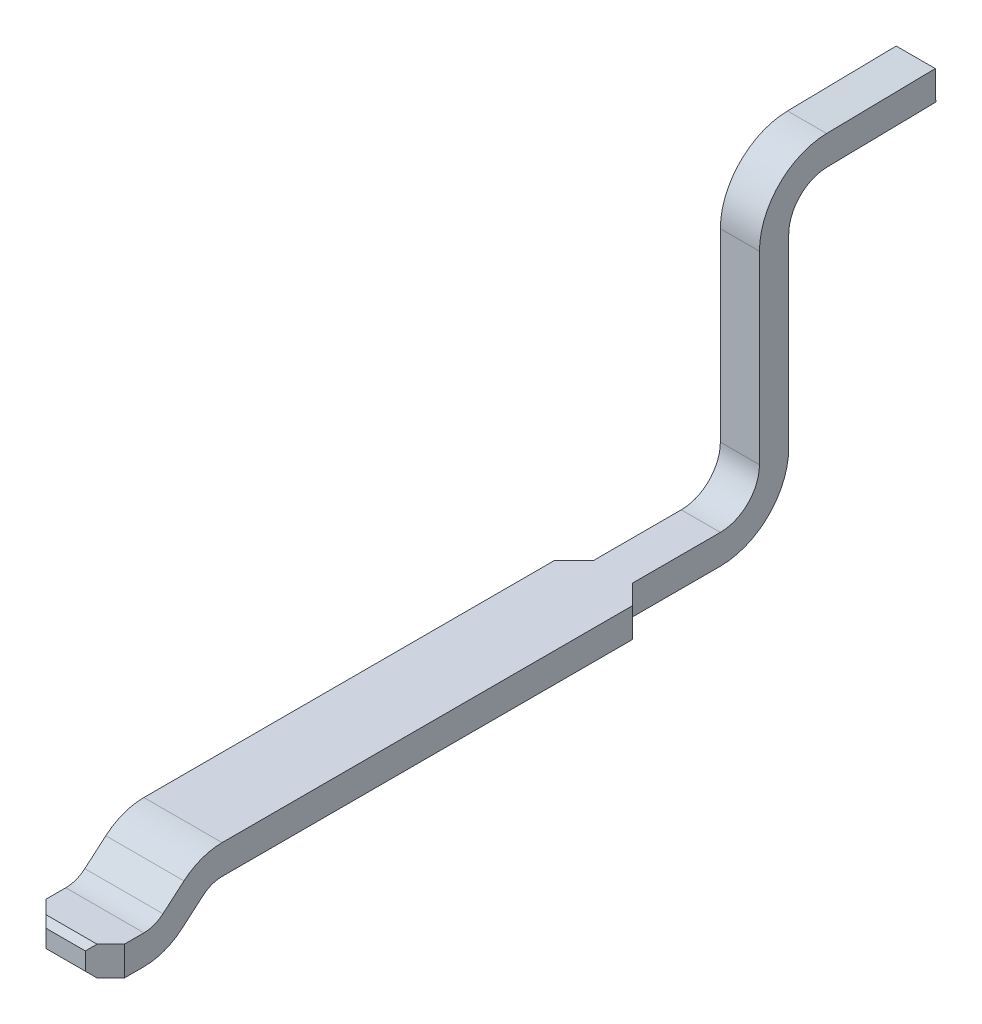
ISO-10303-21;
HEADER;
FILE_DESCRIPTION(('STEP AP214'),'2;1');
FILE_NAME('part.step','',(''),(''),'','','');
FILE_SCHEMA(('AUTOMOTIVE_DESIGN { 1 0 10303 214 1 1 1 1 }'));
ENDSEC;
DATA;
#1=APPLICATION_CONTEXT('core data for automotive mechanical design processes');
#2=APPLICATION_PROTOCOL_DEFINITION('international standard','automotive_design',2000,#1);
#3=PRODUCT_CONTEXT('',#1,'mechanical');
#4=PRODUCT('Part','Part','',(#3));
#5=PRODUCT_RELATED_PRODUCT_CATEGORY('part','',(#4));
#6=PRODUCT_DEFINITION_FORMATION('','',#4);
#7=PRODUCT_DEFINITION_CONTEXT('part definition',#1,'design');
#8=PRODUCT_DEFINITION('design','',#6,#7);
#9=PRODUCT_DEFINITION_SHAPE('','',#8);
#10=(LENGTH_UNIT() NAMED_UNIT(*) SI_UNIT(.MILLI.,.METRE.));
#11=(NAMED_UNIT(*) PLANE_ANGLE_UNIT() SI_UNIT($,.RADIAN.));
#12=(NAMED_UNIT(*) SI_UNIT($,.STERADIAN.) SOLID_ANGLE_UNIT());
#13=UNCERTAINTY_MEASURE_WITH_UNIT(LENGTH_MEASURE(1.E-05),#10,'distance_accuracy_value','');
#14=(GEOMETRIC_REPRESENTATION_CONTEXT(3) GLOBAL_UNCERTAINTY_ASSIGNED_CONTEXT((#13)) GLOBAL_UNIT_ASSIGNED_CONTEXT((#10,
#11,#12)) REPRESENTATION_CONTEXT('',''));
#15=CARTESIAN_POINT('',(0.,0.,0.));
#16=DIRECTION('',(0.,0.,1.));
#17=DIRECTION('',(1.,0.,0.));
#18=AXIS2_PLACEMENT_3D('',#15,#16,#17);
#19=CARTESIAN_POINT('',(-4.19596503503213,8.074228109921,4.324047830079));
#20=DIRECTION('',(0.,0.707106781186548,0.707106781186548));
#21=DIRECTION('',(0.,-0.707106781186548,0.707106781186548));
#22=AXIS2_PLACEMENT_3D('',#19,#20,#21);
#23=PLANE('',#22);
#24=DIRECTION('',(-0.577350269189631,0.577350269189615,-0.577350269189631));
#25=VECTOR('',#24,1.);
#26=CARTESIAN_POINT('',(-4.16026690000013,8.04019892,4.35807702));
#27=LINE('',#26,#25);
#28=CARTESIAN_POINT('',(-4.16026690000013,8.04019892,4.35807702));
#29=VERTEX_POINT('',#28);
#30=CARTESIAN_POINT('',(-4.19026690000013,8.07019892,4.32807702));
#31=VERTEX_POINT('',#30);
#32=EDGE_CURVE('E279',#29,#31,#27,.T.);
#33=ORIENTED_EDGE('',*,*,#32,.F.);
#34=DIRECTION('',(-1.,0.,0.));
#35=VECTOR('',#34,1.);
#36=CARTESIAN_POINT('',(-3.95456876496814,8.04019892,4.35807702));
#37=LINE('',#36,#35);
#38=CARTESIAN_POINT('',(-3.96026690000013,8.04019892,4.35807702));
#39=VERTEX_POINT('',#38);
#40=EDGE_CURVE('E356',#29,#39,#37,.F.);
#41=ORIENTED_EDGE('',*,*,#40,.T.);
#42=DIRECTION('',(-0.577350269189631,-0.577350269189615,0.577350269189631));
#43=VECTOR('',#42,1.);
#44=CARTESIAN_POINT('',(-3.93026690000013,8.07019892,4.32807702));
#45=LINE('',#44,#43);
#46=CARTESIAN_POINT('',(-3.93026690000013,8.07019892,4.32807702));
#47=VERTEX_POINT('',#46);
#48=EDGE_CURVE('E269',#47,#39,#45,.T.);
#49=ORIENTED_EDGE('',*,*,#48,.F.);
#50=DIRECTION('',(1.,0.,0.));
#51=VECTOR('',#50,1.);
#52=CARTESIAN_POINT('',(-3.85226690000013,8.07019892,4.32807702));
#53=LINE('',#52,#51);
#54=EDGE_CURVE('E276',#31,#47,#53,.T.);
#55=ORIENTED_EDGE('',*,*,#54,.F.);
#56=EDGE_LOOP('',(#33,#41,#49,#55));
#57=FACE_BOUND('',#56,.T.);
#58=ADVANCED_FACE('F17',(#57),#23,.T.);
#59=CARTESIAN_POINT('',(-3.95456876496814,7.944500784968,4.35807702));
#60=DIRECTION('',(0.,0.,-1.));
#61=DIRECTION('',(-1.,0.,0.));
#62=AXIS2_PLACEMENT_3D('',#59,#60,#61);
#63=PLANE('',#62);
#64=DIRECTION('',(0.,1.,0.));
#65=VECTOR('',#64,1.);
#66=CARTESIAN_POINT('',(-3.96026690000013,7.914500784968,4.35807702));
#67=LINE('',#66,#65);
#68=CARTESIAN_POINT('',(-3.96026690000013,7.95019892,4.35807702));
#69=VERTEX_POINT('',#68);
#70=EDGE_CURVE('E256',#39,#69,#67,.F.);
#71=ORIENTED_EDGE('',*,*,#70,.F.);
#72=ORIENTED_EDGE('',*,*,#40,.F.);
#73=DIRECTION('',(0.,1.,0.));
#74=VECTOR('',#73,1.);
#75=CARTESIAN_POINT('',(-4.16026690000013,7.914500784968,4.35807702));
#76=LINE('',#75,#74);
#77=CARTESIAN_POINT('',(-4.16026690000013,7.95019892,4.35807702));
#78=VERTEX_POINT('',#77);
#79=EDGE_CURVE('E338',#78,#29,#76,.T.);
#80=ORIENTED_EDGE('',*,*,#79,.F.);
#81=DIRECTION('',(1.,0.,0.));
#82=VECTOR('',#81,1.);
#83=CARTESIAN_POINT('',(-3.92456876496813,7.95019892,4.35807702));
#84=LINE('',#83,#82);
#85=EDGE_CURVE('E331',#69,#78,#84,.F.);
#86=ORIENTED_EDGE('',*,*,#85,.F.);
#87=EDGE_LOOP('',(#71,#72,#80,#86));
#88=FACE_BOUND('',#87,.T.);
#89=ADVANCED_FACE('F775',(#88),#63,.F.);
#90=CARTESIAN_POINT('',(-3.92456876496813,7.916169730079,4.324047830079));
#91=DIRECTION('',(0.,-0.707106781186548,0.707106781186548));
#92=DIRECTION('',(0.,-0.707106781186548,-0.707106781186548));
#93=AXIS2_PLACEMENT_3D('',#90,#91,#92);
#94=PLANE('',#93);
#95=DIRECTION('',(0.57735026918962,-0.577350269189637,-0.57735026918962));
#96=VECTOR('',#95,1.);
#97=CARTESIAN_POINT('',(-3.96026690000013,7.95019892,4.35807702));
#98=LINE('',#97,#96);
#99=CARTESIAN_POINT('',(-3.93026690000013,7.92019892,4.32807702));
#100=VERTEX_POINT('',#99);
#101=EDGE_CURVE('E270',#69,#100,#98,.T.);
#102=ORIENTED_EDGE('',*,*,#101,.F.);
#103=ORIENTED_EDGE('',*,*,#85,.T.);
#104=DIRECTION('',(0.57735026918962,0.577350269189637,0.57735026918962));
#105=VECTOR('',#104,1.);
#106=CARTESIAN_POINT('',(-4.19026690000013,7.92019892,4.32807702));
#107=LINE('',#106,#105);
#108=CARTESIAN_POINT('',(-4.19026690000013,7.92019892,4.32807702));
#109=VERTEX_POINT('',#108);
#110=EDGE_CURVE('E309',#109,#78,#107,.T.);
#111=ORIENTED_EDGE('',*,*,#110,.F.);
#112=DIRECTION('',(1.,0.,0.));
#113=VECTOR('',#112,1.);
#114=CARTESIAN_POINT('',(-3.85226690000013,7.92019892,4.32807702));
#115=LINE('',#114,#113);
#116=EDGE_CURVE('E252',#109,#100,#115,.T.);
#117=ORIENTED_EDGE('',*,*,#116,.T.);
#118=EDGE_LOOP('',(#102,#103,#111,#117));
#119=FACE_BOUND('',#118,.T.);
#120=ADVANCED_FACE('F768',(#119),#94,.T.);
#121=CARTESIAN_POINT('',(-3.95456876496814,8.45127780084181,0.758077020000001));
#122=DIRECTION('',(0.,0.,-1.));
#123=DIRECTION('',(-1.,0.,0.));
#124=AXIS2_PLACEMENT_3D('',#121,#122,#123);
#125=PLANE('',#124);
#126=DIRECTION('',(0.,1.,0.));
#127=VECTOR('',#126,1.);
#128=CARTESIAN_POINT('',(-3.96026690000013,9.610333059471,0.758077020000001));
#129=LINE('',#128,#127);
#130=CARTESIAN_POINT('',(-3.96026690000013,8.47019892,0.758077020000001));
#131=VERTEX_POINT('',#130);
#132=CARTESIAN_POINT('',(-3.96026690000013,9.41625487791,0.758077020000001));
#133=VERTEX_POINT('',#132);
#134=EDGE_CURVE('E416',#131,#133,#129,.T.);
#135=ORIENTED_EDGE('',*,*,#134,.F.);
#136=DIRECTION('',(-1.,0.,0.));
#137=VECTOR('',#136,1.);
#138=CARTESIAN_POINT('',(-3.96026690000013,8.47019892,0.75807702));
#139=LINE('',#138,#137);
#140=CARTESIAN_POINT('',(-4.16026690000013,8.47019892,0.758077020000001));
#141=VERTEX_POINT('',#140);
#142=EDGE_CURVE('E213',#141,#131,#139,.F.);
#143=ORIENTED_EDGE('',*,*,#142,.F.);
#144=DIRECTION('',(0.,1.,0.));
#145=VECTOR('',#144,1.);
#146=CARTESIAN_POINT('',(-4.16026690000013,8.45127780084181,0.758077020000001));
#147=LINE('',#146,#145);
#148=CARTESIAN_POINT('',(-4.16026690000013,9.41625487791,0.758077020000001));
#149=VERTEX_POINT('',#148);
#150=EDGE_CURVE('E412',#149,#141,#147,.F.);
#151=ORIENTED_EDGE('',*,*,#150,.F.);
#152=DIRECTION('',(1.,0.,0.));
#153=VECTOR('',#152,1.);
#154=CARTESIAN_POINT('',(-4.16026690000013,9.41625487791,0.758077020000001));
#155=LINE('',#154,#153);
#156=EDGE_CURVE('E306',#149,#133,#155,.T.);
#157=ORIENTED_EDGE('',*,*,#156,.T.);
#158=EDGE_LOOP('',(#135,#143,#151,#157));
#159=FACE_BOUND('',#158,.T.);
#160=ADVANCED_FACE('F579',(#159),#125,.T.);
#161=CARTESIAN_POINT('',(-3.96026690000013,8.47019892,1.10807702));
#162=DIRECTION('',(-1.,0.,0.));
#163=DIRECTION('',(0.,0.,1.));
#164=AXIS2_PLACEMENT_3D('',#161,#162,#163);
#165=CYLINDRICAL_SURFACE('',#164,0.35);
#166=DIRECTION('',(1.,0.,0.));
#167=VECTOR('',#166,1.);
#168=CARTESIAN_POINT('',(-3.85226690000013,8.12019892,1.10807702));
#169=LINE('',#168,#167);
#170=CARTESIAN_POINT('',(-3.96026690000013,8.12019892,1.10807702));
#171=VERTEX_POINT('',#170);
#172=CARTESIAN_POINT('',(-4.16026690000013,8.12019892,1.10807702));
#173=VERTEX_POINT('',#172);
#174=EDGE_CURVE('E229',#171,#173,#169,.F.);
#175=ORIENTED_EDGE('',*,*,#174,.T.);
#176=CARTESIAN_POINT('',(-4.16026690000013,8.47019892,1.10807702));
#177=DIRECTION('',(-1.,0.,0.));
#178=DIRECTION('',(0.,0.,1.));
#179=AXIS2_PLACEMENT_3D('',#176,#177,#178);
#180=CIRCLE('',#179,0.35);
#181=EDGE_CURVE('E409',#141,#173,#180,.T.);
#182=ORIENTED_EDGE('',*,*,#181,.F.);
#183=ORIENTED_EDGE('',*,*,#142,.T.);
#184=CARTESIAN_POINT('',(-3.96026690000013,8.47019892,1.10807702));
#185=DIRECTION('',(-1.,0.,0.));
#186=DIRECTION('',(0.,0.,1.));
#187=AXIS2_PLACEMENT_3D('',#184,#185,#186);
#188=CIRCLE('',#187,0.35);
#189=EDGE_CURVE('E417',#171,#131,#188,.F.);
#190=ORIENTED_EDGE('',*,*,#189,.F.);
#191=EDGE_LOOP('',(#175,#182,#183,#190));
#192=FACE_BOUND('',#191,.T.);
#193=ADVANCED_FACE('F576',(#192),#165,.T.);
#194=CARTESIAN_POINT('',(-3.95456876496814,8.45127780084181,0.908077020000001));
#195=DIRECTION('',(0.,0.,-1.));
#196=DIRECTION('',(-1.,0.,0.));
#197=AXIS2_PLACEMENT_3D('',#194,#195,#196);
#198=PLANE('',#197);
#199=DIRECTION('',(-1.,0.,0.));
#200=VECTOR('',#199,1.);
#201=CARTESIAN_POINT('',(-3.96026690000013,8.47019892,0.90807702));
#202=LINE('',#201,#200);
#203=CARTESIAN_POINT('',(-4.16026690000013,8.47019892,0.908077020000001));
#204=VERTEX_POINT('',#203);
#205=CARTESIAN_POINT('',(-3.96026690000013,8.47019892,0.908077020000001));
#206=VERTEX_POINT('',#205);
#207=EDGE_CURVE('E218',#204,#206,#202,.F.);
#208=ORIENTED_EDGE('',*,*,#207,.T.);
#209=DIRECTION('',(0.,1.,0.));
#210=VECTOR('',#209,1.);
#211=CARTESIAN_POINT('',(-3.96026690000013,9.610333059471,0.908077020000001));
#212=LINE('',#211,#210);
#213=CARTESIAN_POINT('',(-3.96026690000013,9.41625487791,0.908077020000001));
#214=VERTEX_POINT('',#213);
#215=EDGE_CURVE('E216',#214,#206,#212,.F.);
#216=ORIENTED_EDGE('',*,*,#215,.F.);
#217=DIRECTION('',(1.,0.,0.));
#218=VECTOR('',#217,1.);
#219=CARTESIAN_POINT('',(-4.16026690000013,9.41625487791,0.908077020000001));
#220=LINE('',#219,#218);
#221=CARTESIAN_POINT('',(-4.16026690000013,9.41625487791,0.908077020000001));
#222=VERTEX_POINT('',#221);
#223=EDGE_CURVE('E203',#222,#214,#220,.T.);
#224=ORIENTED_EDGE('',*,*,#223,.F.);
#225=DIRECTION('',(0.,1.,0.));
#226=VECTOR('',#225,1.);
#227=CARTESIAN_POINT('',(-4.16026690000013,8.45127780084181,0.908077020000001));
#228=LINE('',#227,#226);
#229=EDGE_CURVE('E404',#204,#222,#228,.T.);
#230=ORIENTED_EDGE('',*,*,#229,.F.);
#231=EDGE_LOOP('',(#208,#216,#224,#230));
#232=FACE_BOUND('',#231,.T.);
#233=ADVANCED_FACE('F217',(#232),#198,.F.);
#234=CARTESIAN_POINT('',(-4.16026690000013,9.41625487791,0.558077020000001));
#235=DIRECTION('',(1.,0.,0.));
#236=DIRECTION('',(0.,0.,-1.));
#237=AXIS2_PLACEMENT_3D('',#234,#235,#236);
#238=CYLINDRICAL_SURFACE('',#237,0.35);
#239=ORIENTED_EDGE('',*,*,#223,.T.);
#240=CARTESIAN_POINT('',(-3.96026690000013,9.41625487791,0.558077020000001));
#241=DIRECTION('',(1.,0.,0.));
#242=DIRECTION('',(0.,0.,-1.));
#243=AXIS2_PLACEMENT_3D('',#240,#241,#242);
#244=CIRCLE('',#243,0.35);
#245=CARTESIAN_POINT('',(-3.96026690000013,9.76620157121429,0.564185362253241));
#246=VERTEX_POINT('',#245);
#247=EDGE_CURVE('E20',#246,#214,#244,.T.);
#248=ORIENTED_EDGE('',*,*,#247,.F.);
#249=DIRECTION('',(1.,0.,0.));
#250=VECTOR('',#249,1.);
#251=CARTESIAN_POINT('',(-4.16596503503214,9.76620157121458,0.564185362253011));
#252=LINE('',#251,#250);
#253=CARTESIAN_POINT('',(-4.16026690000013,9.76620157121429,0.564185362253241));
#254=VERTEX_POINT('',#253);
#255=EDGE_CURVE('E198',#254,#246,#252,.T.);
#256=ORIENTED_EDGE('',*,*,#255,.F.);
#257=CARTESIAN_POINT('',(-4.16026690000013,9.41625487791,0.558077020000001));
#258=DIRECTION('',(1.,0.,0.));
#259=DIRECTION('',(0.,0.,-1.));
#260=AXIS2_PLACEMENT_3D('',#257,#258,#259);
#261=CIRCLE('',#260,0.35);
#262=EDGE_CURVE('E209',#222,#254,#261,.F.);
#263=ORIENTED_EDGE('',*,*,#262,.F.);
#264=EDGE_LOOP('',(#239,#248,#256,#263));
#265=FACE_BOUND('',#264,.T.);
#266=ADVANCED_FACE('F205',(#265),#238,.T.);
#267=CARTESIAN_POINT('',(-4.16596503503214,9.766007480923,0.575304787611001));
#268=DIRECTION('',(0.,0.999847695156406,0.0174524064364471));
#269=DIRECTION('',(0.,-0.0174524064364471,0.999847695156406));
#270=AXIS2_PLACEMENT_3D('',#267,#268,#269);
#271=PLANE('',#270);
#272=DIRECTION('',(0.,0.0174524064385203,-0.99984769515637));
#273=VECTOR('',#272,1.);
#274=CARTESIAN_POINT('',(-4.16026690000013,9.766201571214,0.564185362253001));
#275=LINE('',#274,#273);
#276=CARTESIAN_POINT('',(-4.16026690000013,9.775906085794,0.00821409435916126));
#277=VERTEX_POINT('',#276);
#278=EDGE_CURVE('E318',#254,#277,#275,.T.);
#279=ORIENTED_EDGE('',*,*,#278,.F.);
#280=ORIENTED_EDGE('',*,*,#255,.T.);
#281=DIRECTION('',(0.,-0.0174524064385203,0.99984769515637));
#282=VECTOR('',#281,1.);
#283=CARTESIAN_POINT('',(-3.96026690000013,9.775906085794,0.00821409435900074));
#284=LINE('',#283,#282);
#285=CARTESIAN_POINT('',(-3.96026690000013,9.775906085794,0.00821409435916126));
#286=VERTEX_POINT('',#285);
#287=EDGE_CURVE('E226',#286,#246,#284,.T.);
#288=ORIENTED_EDGE('',*,*,#287,.F.);
#289=DIRECTION('',(1.,0.,0.));
#290=VECTOR('',#289,1.);
#291=CARTESIAN_POINT('',(-3.95456876496814,9.77590608579399,0.0082140943594823));
#292=LINE('',#291,#290);
#293=EDGE_CURVE('E311',#277,#286,#292,.T.);
#294=ORIENTED_EDGE('',*,*,#293,.F.);
#295=EDGE_LOOP('',(#279,#280,#288,#294));
#296=FACE_BOUND('',#295,.T.);
#297=ADVANCED_FACE('F593',(#296),#271,.T.);
#298=CARTESIAN_POINT('',(-3.95456876496814,9.620231664342,0.00549678722500089));
#299=DIRECTION('',(0.,0.0174524064396861,-0.999847695156349));
#300=DIRECTION('',(0.,0.999847695156349,0.0174524064396861));
#301=AXIS2_PLACEMENT_3D('',#298,#299,#300);
#302=PLANE('',#301);
#303=DIRECTION('',(1.,0.,0.));
#304=VECTOR('',#303,1.);
#305=CARTESIAN_POINT('',(-4.16596503503214,9.62592893152041,0.00559623339400797));
#306=LINE('',#305,#304);
#307=CARTESIAN_POINT('',(-3.96026690000013,9.62592893152018,0.00559623339400417));
#308=VERTEX_POINT('',#307);
#309=CARTESIAN_POINT('',(-4.16026690000013,9.62592893152014,0.00559623339400334));
#310=VERTEX_POINT('',#309);
#311=EDGE_CURVE('E307',#308,#310,#306,.F.);
#312=ORIENTED_EDGE('',*,*,#311,.T.);
#313=DIRECTION('',(0.,-0.999847695156461,-0.0174524064332696));
#314=VECTOR('',#313,1.);
#315=CARTESIAN_POINT('',(-4.16026690000013,9.775906085794,0.00821409435900074));
#316=LINE('',#315,#314);
#317=EDGE_CURVE('E314',#277,#310,#316,.T.);
#318=ORIENTED_EDGE('',*,*,#317,.F.);
#319=ORIENTED_EDGE('',*,*,#293,.T.);
#320=DIRECTION('',(0.,0.999847695156461,0.0174524064332696));
#321=VECTOR('',#320,1.);
#322=CARTESIAN_POINT('',(-3.96026690000013,9.62592893152,0.00559623339400103));
#323=LINE('',#322,#321);
#324=EDGE_CURVE('E328',#308,#286,#323,.T.);
#325=ORIENTED_EDGE('',*,*,#324,.F.);
#326=EDGE_LOOP('',(#312,#318,#319,#325));
#327=FACE_BOUND('',#326,.T.);
#328=ADVANCED_FACE('F592',(#327),#302,.T.);
#329=CARTESIAN_POINT('',(-4.16596503503214,9.616030326649,0.572686926645001));
#330=DIRECTION('',(0.,0.999847695156375,0.0174524064382066));
#331=DIRECTION('',(0.,-0.0174524064382066,0.999847695156375));
#332=AXIS2_PLACEMENT_3D('',#329,#330,#331);
#333=PLANE('',#332);
#334=DIRECTION('',(1.,0.,0.));
#335=VECTOR('',#334,1.);
#336=CARTESIAN_POINT('',(-4.16026690000013,9.61622441694128,0.561567501287006));
#337=LINE('',#336,#335);
#338=CARTESIAN_POINT('',(-3.96026690000013,9.61622441694114,0.561567501287176));
#339=VERTEX_POINT('',#338);
#340=CARTESIAN_POINT('',(-4.16026690000013,9.61622441694114,0.561567501287176));
#341=VERTEX_POINT('',#340);
#342=EDGE_CURVE('E304',#339,#341,#337,.F.);
#343=ORIENTED_EDGE('',*,*,#342,.T.);
#344=DIRECTION('',(0.,-0.0174524064367521,0.999847695156401));
#345=VECTOR('',#344,1.);
#346=CARTESIAN_POINT('',(-4.16026690000013,9.62592893152,0.00559623339400103));
#347=LINE('',#346,#345);
#348=EDGE_CURVE('E317',#310,#341,#347,.T.);
#349=ORIENTED_EDGE('',*,*,#348,.F.);
#350=ORIENTED_EDGE('',*,*,#311,.F.);
#351=DIRECTION('',(0.,0.0174524064367521,-0.999847695156401));
#352=VECTOR('',#351,1.);
#353=CARTESIAN_POINT('',(-3.96026690000013,9.616224416941,0.561567501287001));
#354=LINE('',#353,#352);
#355=EDGE_CURVE('E333',#339,#308,#354,.T.);
#356=ORIENTED_EDGE('',*,*,#355,.F.);
#357=EDGE_LOOP('',(#343,#349,#350,#356));
#358=FACE_BOUND('',#357,.T.);
#359=ADVANCED_FACE('F588',(#358),#333,.F.);
#360=CARTESIAN_POINT('',(-4.16026690000013,9.41625487791,0.558077020000001));
#361=DIRECTION('',(1.,0.,0.));
#362=DIRECTION('',(0.,0.,-1.));
#363=AXIS2_PLACEMENT_3D('',#360,#361,#362);
#364=CYLINDRICAL_SURFACE('',#363,0.2);
#365=ORIENTED_EDGE('',*,*,#156,.F.);
#366=CARTESIAN_POINT('',(-4.16026690000013,9.41625487791,0.558077020000001));
#367=DIRECTION('',(1.,0.,0.));
#368=DIRECTION('',(0.,0.,-1.));
#369=AXIS2_PLACEMENT_3D('',#366,#367,#368);
#370=CIRCLE('',#369,0.2);
#371=EDGE_CURVE('E400',#341,#149,#370,.T.);
#372=ORIENTED_EDGE('',*,*,#371,.F.);
#373=ORIENTED_EDGE('',*,*,#342,.F.);
#374=CARTESIAN_POINT('',(-3.96026690000013,9.41625487791,0.558077020000001));
#375=DIRECTION('',(1.,0.,0.));
#376=DIRECTION('',(0.,0.,-1.));
#377=AXIS2_PLACEMENT_3D('',#374,#375,#376);
#378=CIRCLE('',#377,0.2);
#379=EDGE_CURVE('E414',#133,#339,#378,.F.);
#380=ORIENTED_EDGE('',*,*,#379,.F.);
#381=EDGE_LOOP('',(#365,#372,#373,#380));
#382=FACE_BOUND('',#381,.T.);
#383=ADVANCED_FACE('F584',(#382),#364,.F.);
#384=CARTESIAN_POINT('',(-4.26429608992113,7.914500784968,4.254047830079));
#385=DIRECTION('',(-0.707106781186548,0.,0.707106781186548));
#386=DIRECTION('',(0.707106781186548,0.,0.707106781186548));
#387=AXIS2_PLACEMENT_3D('',#384,#385,#386);
#388=PLANE('',#387);
#389=DIRECTION('',(0.,1.,0.));
#390=VECTOR('',#389,1.);
#391=CARTESIAN_POINT('',(-4.26026690000013,7.914500784968,4.25807702));
#392=LINE('',#391,#390);
#393=CARTESIAN_POINT('',(-4.26026690000013,8.07019892,4.25807702));
#394=VERTEX_POINT('',#393);
#395=CARTESIAN_POINT('',(-4.26026690000013,7.92019892,4.25807702));
#396=VERTEX_POINT('',#395);
#397=EDGE_CURVE('E295',#394,#396,#392,.F.);
#398=ORIENTED_EDGE('',*,*,#397,.T.);
#399=DIRECTION('',(0.707106781186548,0.,0.707106781186548));
#400=VECTOR('',#399,1.);
#401=CARTESIAN_POINT('',(-4.26026690000013,7.92019892,4.25807702));
#402=LINE('',#401,#400);
#403=EDGE_CURVE('E255',#396,#109,#402,.T.);
#404=ORIENTED_EDGE('',*,*,#403,.T.);
#405=ORIENTED_EDGE('',*,*,#110,.T.);
#406=ORIENTED_EDGE('',*,*,#79,.T.);
#407=ORIENTED_EDGE('',*,*,#32,.T.);
#408=DIRECTION('',(0.707106781186548,0.,0.707106781186548));
#409=VECTOR('',#408,1.);
#410=CARTESIAN_POINT('',(-4.26026690000013,8.07019892,4.25807702));
#411=LINE('',#410,#409);
#412=EDGE_CURVE('E275',#394,#31,#411,.T.);
#413=ORIENTED_EDGE('',*,*,#412,.F.);
#414=EDGE_LOOP('',(#398,#404,#405,#406,#407,#413));
#415=FACE_BOUND('',#414,.T.);
#416=ADVANCED_FACE('F712',(#415),#388,.T.);
#417=CARTESIAN_POINT('',(-3.85226690000013,8.102515836027,4.064893542443));
#418=DIRECTION('',(0.,0.759858617954068,0.650088363779058));
#419=DIRECTION('',(0.,-0.650088363779058,0.759858617954068));
#420=AXIS2_PLACEMENT_3D('',#417,#418,#419);
#421=PLANE('',#420);
#422=DIRECTION('',(0.,-0.650088363774947,0.759858617957586));
#423=VECTOR('',#422,1.);
#424=CARTESIAN_POINT('',(-4.26026690000013,8.198156505386,3.953103529133));
#425=LINE('',#424,#423);
#426=CARTESIAN_POINT('',(-4.26026690000013,8.19815650538664,3.95310352913274));
#427=VERTEX_POINT('',#426);
#428=CARTESIAN_POINT('',(-4.26026690000013,8.10622012730668,4.06056376543338));
#429=VERTEX_POINT('',#428);
#430=EDGE_CURVE('E393',#427,#429,#425,.T.);
#431=ORIENTED_EDGE('',*,*,#430,.T.);
#432=DIRECTION('',(-1.,0.,0.));
#433=VECTOR('',#432,1.);
#434=CARTESIAN_POINT('',(-3.86026690000013,8.10622012730701,4.06056376543301));
#435=LINE('',#434,#433);
#436=CARTESIAN_POINT('',(-3.86026690000013,8.10622012730668,4.06056376543338));
#437=VERTEX_POINT('',#436);
#438=EDGE_CURVE('E277',#429,#437,#435,.F.);
#439=ORIENTED_EDGE('',*,*,#438,.T.);
#440=DIRECTION('',(0.,-0.650088363774947,0.759858617957586));
#441=VECTOR('',#440,1.);
#442=CARTESIAN_POINT('',(-3.86026690000013,8.198156505386,3.953103529133));
#443=LINE('',#442,#441);
#444=CARTESIAN_POINT('',(-3.86026690000013,8.19815650538664,3.95310352913274));
#445=VERTEX_POINT('',#444);
#446=EDGE_CURVE('E385',#445,#437,#443,.T.);
#447=ORIENTED_EDGE('',*,*,#446,.F.);
#448=DIRECTION('',(-1.,0.,0.));
#449=VECTOR('',#448,1.);
#450=CARTESIAN_POINT('',(-3.86026690000013,8.19815650538648,3.95310352913341));
#451=LINE('',#450,#449);
#452=EDGE_CURVE('E280',#427,#445,#451,.F.);
#453=ORIENTED_EDGE('',*,*,#452,.F.);
#454=EDGE_LOOP('',(#431,#439,#447,#453));
#455=FACE_BOUND('',#454,.T.);
#456=ADVANCED_FACE('F528',(#455),#421,.T.);
#457=CARTESIAN_POINT('',(-3.86026690000013,8.22019892,4.15807702));
#458=DIRECTION('',(-1.,0.,0.));
#459=DIRECTION('',(0.,0.,1.));
#460=AXIS2_PLACEMENT_3D('',#457,#458,#459);
#461=CYLINDRICAL_SURFACE('',#460,0.15);
#462=CARTESIAN_POINT('',(-4.26026690000013,8.22019892,4.15807702));
#463=DIRECTION('',(-1.,0.,0.));
#464=DIRECTION('',(0.,0.,1.));
#465=AXIS2_PLACEMENT_3D('',#462,#463,#464);
#466=CIRCLE('',#465,0.15);
#467=CARTESIAN_POINT('',(-4.26026690000013,8.07019892,4.15807702));
#468=VERTEX_POINT('',#467);
#469=EDGE_CURVE('E390',#429,#468,#466,.T.);
#470=ORIENTED_EDGE('',*,*,#469,.T.);
#471=DIRECTION('',(1.,0.,0.));
#472=VECTOR('',#471,1.);
#473=CARTESIAN_POINT('',(-3.85226690000013,8.07019892,4.15807702));
#474=LINE('',#473,#472);
#475=CARTESIAN_POINT('',(-3.86026690000013,8.07019892,4.15807702));
#476=VERTEX_POINT('',#475);
#477=EDGE_CURVE('E273',#476,#468,#474,.F.);
#478=ORIENTED_EDGE('',*,*,#477,.F.);
#479=CARTESIAN_POINT('',(-3.86026690000013,8.22019892,4.15807702));
#480=DIRECTION('',(-1.,0.,0.));
#481=DIRECTION('',(0.,0.,1.));
#482=AXIS2_PLACEMENT_3D('',#479,#480,#481);
#483=CIRCLE('',#482,0.15);
#484=EDGE_CURVE('E382',#437,#476,#483,.T.);
#485=ORIENTED_EDGE('',*,*,#484,.F.);
#486=ORIENTED_EDGE('',*,*,#438,.F.);
#487=EDGE_LOOP('',(#470,#478,#485,#486));
#488=FACE_BOUND('',#487,.T.);
#489=ADVANCED_FACE('F533',(#488),#461,.F.);
#490=CARTESIAN_POINT('',(-3.85226690000013,8.07019892,4.333775155032));
#491=DIRECTION('',(0.,1.,0.));
#492=DIRECTION('',(0.,0.,1.));
#493=AXIS2_PLACEMENT_3D('',#490,#491,#492);
#494=PLANE('',#493);
#495=DIRECTION('',(0.,0.,-1.));
#496=VECTOR('',#495,1.);
#497=CARTESIAN_POINT('',(-4.26026690000013,8.07019892,4.163775155032));
#498=LINE('',#497,#496);
#499=EDGE_CURVE('E287',#468,#394,#498,.F.);
#500=ORIENTED_EDGE('',*,*,#499,.T.);
#501=ORIENTED_EDGE('',*,*,#412,.T.);
#502=ORIENTED_EDGE('',*,*,#54,.T.);
#503=DIRECTION('',(0.707106781186548,0.,-0.707106781186548));
#504=VECTOR('',#503,1.);
#505=CARTESIAN_POINT('',(-3.96429608992113,8.07019892,4.362106209921));
#506=LINE('',#505,#504);
#507=CARTESIAN_POINT('',(-3.86026690000013,8.07019892,4.25807702));
#508=VERTEX_POINT('',#507);
#509=EDGE_CURVE('E266',#508,#47,#506,.F.);
#510=ORIENTED_EDGE('',*,*,#509,.F.);
#511=DIRECTION('',(0.,0.,-1.));
#512=VECTOR('',#511,1.);
#513=CARTESIAN_POINT('',(-3.86026690000013,8.07019892,3.80007702));
#514=LINE('',#513,#512);
#515=EDGE_CURVE('E263',#476,#508,#514,.F.);
#516=ORIENTED_EDGE('',*,*,#515,.F.);
#517=ORIENTED_EDGE('',*,*,#477,.T.);
#518=EDGE_LOOP('',(#500,#501,#502,#510,#516,#517));
#519=FACE_BOUND('',#518,.T.);
#520=ADVANCED_FACE('F537',(#519),#494,.T.);
#521=CARTESIAN_POINT('',(-3.96429608992113,7.914500784968,4.362106209921));
#522=DIRECTION('',(0.707106781186548,0.,0.707106781186548));
#523=DIRECTION('',(0.707106781186548,0.,-0.707106781186548));
#524=AXIS2_PLACEMENT_3D('',#521,#522,#523);
#525=PLANE('',#524);
#526=ORIENTED_EDGE('',*,*,#48,.T.);
#527=ORIENTED_EDGE('',*,*,#70,.T.);
#528=ORIENTED_EDGE('',*,*,#101,.T.);
#529=DIRECTION('',(0.707106781186543,0.,-0.707106781186552));
#530=VECTOR('',#529,1.);
#531=CARTESIAN_POINT('',(-3.93026690000013,7.92019892,4.32807702));
#532=LINE('',#531,#530);
#533=CARTESIAN_POINT('',(-3.86026690000013,7.92019892,4.25807702));
#534=VERTEX_POINT('',#533);
#535=EDGE_CURVE('E253',#100,#534,#532,.T.);
#536=ORIENTED_EDGE('',*,*,#535,.T.);
#537=DIRECTION('',(0.,1.,0.));
#538=VECTOR('',#537,1.);
#539=CARTESIAN_POINT('',(-3.86026690000013,8.114500784968,4.25807702));
#540=LINE('',#539,#538);
#541=EDGE_CURVE('E259',#508,#534,#540,.F.);
#542=ORIENTED_EDGE('',*,*,#541,.F.);
#543=ORIENTED_EDGE('',*,*,#509,.T.);
#544=EDGE_LOOP('',(#526,#527,#528,#536,#542,#543));
#545=FACE_BOUND('',#544,.T.);
#546=ADVANCED_FACE('F540',(#545),#525,.T.);
#547=CARTESIAN_POINT('',(-3.85226690000013,7.92019892,4.333775155032));
#548=DIRECTION('',(0.,1.,0.));
#549=DIRECTION('',(0.,0.,1.));
#550=AXIS2_PLACEMENT_3D('',#547,#548,#549);
#551=PLANE('',#550);
#552=ORIENTED_EDGE('',*,*,#403,.F.);
#553=DIRECTION('',(0.,0.,-1.));
#554=VECTOR('',#553,1.);
#555=CARTESIAN_POINT('',(-4.26026690000013,7.92019892,4.163775155032));
#556=LINE('',#555,#554);
#557=CARTESIAN_POINT('',(-4.26026690000013,7.92019892,4.15807702));
#558=VERTEX_POINT('',#557);
#559=EDGE_CURVE('E297',#396,#558,#556,.T.);
#560=ORIENTED_EDGE('',*,*,#559,.T.);
#561=DIRECTION('',(-1.,0.,0.));
#562=VECTOR('',#561,1.);
#563=CARTESIAN_POINT('',(-3.86026690000013,7.92019892,4.15807702));
#564=LINE('',#563,#562);
#565=CARTESIAN_POINT('',(-3.86026690000013,7.92019892,4.15807702));
#566=VERTEX_POINT('',#565);
#567=EDGE_CURVE('E249',#566,#558,#564,.T.);
#568=ORIENTED_EDGE('',*,*,#567,.F.);
#569=DIRECTION('',(0.,0.,-1.));
#570=VECTOR('',#569,1.);
#571=CARTESIAN_POINT('',(-3.86026690000013,7.92019892,3.80007702));
#572=LINE('',#571,#570);
#573=EDGE_CURVE('E262',#534,#566,#572,.T.);
#574=ORIENTED_EDGE('',*,*,#573,.F.);
#575=ORIENTED_EDGE('',*,*,#535,.F.);
#576=ORIENTED_EDGE('',*,*,#116,.F.);
#577=EDGE_LOOP('',(#552,#560,#568,#574,#575,#576));
#578=FACE_BOUND('',#577,.T.);
#579=ADVANCED_FACE('F547',(#578),#551,.F.);
#580=CARTESIAN_POINT('',(-3.86026690000013,8.22019892,4.15807702));
#581=DIRECTION('',(-1.,0.,0.));
#582=DIRECTION('',(0.,0.,1.));
#583=AXIS2_PLACEMENT_3D('',#580,#581,#582);
#584=CYLINDRICAL_SURFACE('',#583,0.3);
#585=CARTESIAN_POINT('',(-4.26026690000013,8.22019892,4.15807702));
#586=DIRECTION('',(-1.,0.,0.));
#587=DIRECTION('',(0.,0.,1.));
#588=AXIS2_PLACEMENT_3D('',#585,#586,#587);
#589=CIRCLE('',#588,0.3);
#590=CARTESIAN_POINT('',(-4.26026690000013,7.99224133461339,3.96305051086728));
#591=VERTEX_POINT('',#590);
#592=EDGE_CURVE('E398',#558,#591,#589,.F.);
#593=ORIENTED_EDGE('',*,*,#592,.T.);
#594=DIRECTION('',(1.,0.,0.));
#595=VECTOR('',#594,1.);
#596=CARTESIAN_POINT('',(-3.85226690000013,7.99224133461357,3.96305051086664));
#597=LINE('',#596,#595);
#598=CARTESIAN_POINT('',(-3.86026690000013,7.99224133461339,3.96305051086728));
#599=VERTEX_POINT('',#598);
#600=EDGE_CURVE('E247',#591,#599,#597,.T.);
#601=ORIENTED_EDGE('',*,*,#600,.T.);
#602=CARTESIAN_POINT('',(-3.86026690000013,8.22019892,4.15807702));
#603=DIRECTION('',(-1.,0.,0.));
#604=DIRECTION('',(0.,0.,1.));
#605=AXIS2_PLACEMENT_3D('',#602,#603,#604);
#606=CIRCLE('',#605,0.3);
#607=EDGE_CURVE('E379',#566,#599,#606,.F.);
#608=ORIENTED_EDGE('',*,*,#607,.F.);
#609=ORIENTED_EDGE('',*,*,#567,.T.);
#610=EDGE_LOOP('',(#593,#601,#608,#609));
#611=FACE_BOUND('',#610,.T.);
#612=ADVANCED_FACE('F551',(#611),#584,.T.);
#613=CARTESIAN_POINT('',(-3.85226690000013,7.988537043334,3.967380287877));
#614=DIRECTION('',(0.,0.759858617954068,0.650088363779058));
#615=DIRECTION('',(0.,-0.650088363779058,0.759858617954068));
#616=AXIS2_PLACEMENT_3D('',#613,#614,#615);
#617=PLANE('',#616);
#618=ORIENTED_EDGE('',*,*,#600,.F.);
#619=DIRECTION('',(0.,0.650088363774937,-0.759858617957595));
#620=VECTOR('',#619,1.);
#621=CARTESIAN_POINT('',(-4.26026690000013,7.992241334614,3.963050510867));
#622=LINE('',#621,#620);
#623=CARTESIAN_POINT('',(-4.26026690000013,8.08417771269332,3.85559027456662));
#624=VERTEX_POINT('',#623);
#625=EDGE_CURVE('E397',#591,#624,#622,.T.);
#626=ORIENTED_EDGE('',*,*,#625,.T.);
#627=DIRECTION('',(-1.,0.,0.));
#628=VECTOR('',#627,1.);
#629=CARTESIAN_POINT('',(-3.86026690000013,8.08417771269299,3.85559027456699));
#630=LINE('',#629,#628);
#631=CARTESIAN_POINT('',(-3.86026690000013,8.08417771269332,3.85559027456662));
#632=VERTEX_POINT('',#631);
#633=EDGE_CURVE('E243',#624,#632,#630,.F.);
#634=ORIENTED_EDGE('',*,*,#633,.T.);
#635=DIRECTION('',(0.,0.650088363774937,-0.759858617957595));
#636=VECTOR('',#635,1.);
#637=CARTESIAN_POINT('',(-3.86026690000013,7.992241334614,3.963050510867));
#638=LINE('',#637,#636);
#639=EDGE_CURVE('E378',#599,#632,#638,.T.);
#640=ORIENTED_EDGE('',*,*,#639,.F.);
#641=EDGE_LOOP('',(#618,#626,#634,#640));
#642=FACE_BOUND('',#641,.T.);
#643=ADVANCED_FACE('F556',(#642),#617,.F.);
#644=CARTESIAN_POINT('',(-3.86026690000013,7.97019892,3.75807702));
#645=DIRECTION('',(-1.,0.,0.));
#646=DIRECTION('',(0.,0.,1.));
#647=AXIS2_PLACEMENT_3D('',#644,#645,#646);
#648=CYLINDRICAL_SURFACE('',#647,0.15);
#649=CARTESIAN_POINT('',(-4.26026690000013,7.97019892,3.75807702));
#650=DIRECTION('',(-1.,0.,0.));
#651=DIRECTION('',(0.,0.,1.));
#652=AXIS2_PLACEMENT_3D('',#649,#650,#651);
#653=CIRCLE('',#652,0.15);
#654=CARTESIAN_POINT('',(-4.26026690000013,8.12019892,3.75807702));
#655=VERTEX_POINT('',#654);
#656=EDGE_CURVE('E394',#624,#655,#653,.T.);
#657=ORIENTED_EDGE('',*,*,#656,.T.);
#658=DIRECTION('',(1.,0.,0.));
#659=VECTOR('',#658,1.);
#660=CARTESIAN_POINT('',(-3.85226690000013,8.12019892,3.75807702));
#661=LINE('',#660,#659);
#662=CARTESIAN_POINT('',(-3.86026690000013,8.12019892,3.75807702));
#663=VERTEX_POINT('',#662);
#664=EDGE_CURVE('E227',#655,#663,#661,.T.);
#665=ORIENTED_EDGE('',*,*,#664,.T.);
#666=CARTESIAN_POINT('',(-3.86026690000013,7.97019892,3.75807702));
#667=DIRECTION('',(-1.,0.,0.));
#668=DIRECTION('',(0.,0.,1.));
#669=AXIS2_PLACEMENT_3D('',#666,#667,#668);
#670=CIRCLE('',#669,0.15);
#671=EDGE_CURVE('E374',#632,#663,#670,.T.);
#672=ORIENTED_EDGE('',*,*,#671,.F.);
#673=ORIENTED_EDGE('',*,*,#633,.F.);
#674=EDGE_LOOP('',(#657,#665,#672,#673));
#675=FACE_BOUND('',#674,.T.);
#676=ADVANCED_FACE('F560',(#675),#648,.F.);
#677=CARTESIAN_POINT('',(-3.85226690000013,8.12019892,3.81107702));
#678=DIRECTION('',(0.,1.,0.));
#679=DIRECTION('',(0.,0.,1.));
#680=AXIS2_PLACEMENT_3D('',#677,#678,#679);
#681=PLANE('',#680);
#682=ORIENTED_EDGE('',*,*,#664,.F.);
#683=DIRECTION('',(0.,0.,-1.));
#684=VECTOR('',#683,1.);
#685=CARTESIAN_POINT('',(-4.26026690000013,8.12019892,4.163775155032));
#686=LINE('',#685,#684);
#687=CARTESIAN_POINT('',(-4.26026690000013,8.12019892,1.65807702));
#688=VERTEX_POINT('',#687);
#689=EDGE_CURVE('E396',#655,#688,#686,.T.);
#690=ORIENTED_EDGE('',*,*,#689,.T.);
#691=DIRECTION('',(-0.707106781186548,0.,0.707106781186548));
#692=VECTOR('',#691,1.);
#693=CARTESIAN_POINT('',(-4.26429608992113,8.12019892,1.662106209921));
#694=LINE('',#693,#692);
#695=CARTESIAN_POINT('',(-4.16026690000013,8.12019892,1.55807702));
#696=VERTEX_POINT('',#695);
#697=EDGE_CURVE('E284',#696,#688,#694,.T.);
#698=ORIENTED_EDGE('',*,*,#697,.F.);
#699=DIRECTION('',(0.,0.,1.));
#700=VECTOR('',#699,1.);
#701=CARTESIAN_POINT('',(-4.16026690000013,8.12019892,0.913775155032));
#702=LINE('',#701,#700);
#703=EDGE_CURVE('E408',#173,#696,#702,.T.);
#704=ORIENTED_EDGE('',*,*,#703,.F.);
#705=ORIENTED_EDGE('',*,*,#174,.F.);
#706=DIRECTION('',(0.,0.,-1.));
#707=VECTOR('',#706,1.);
#708=CARTESIAN_POINT('',(-3.96026690000013,8.12019892,0.572587480477));
#709=LINE('',#708,#707);
#710=CARTESIAN_POINT('',(-3.96026690000013,8.12019892,1.55807702));
#711=VERTEX_POINT('',#710);
#712=EDGE_CURVE('E221',#711,#171,#709,.T.);
#713=ORIENTED_EDGE('',*,*,#712,.F.);
#714=DIRECTION('',(-0.707106781186546,0.,-0.707106781186549));
#715=VECTOR('',#714,1.);
#716=CARTESIAN_POINT('',(-3.86026690000013,8.12019892,1.65807702));
#717=LINE('',#716,#715);
#718=CARTESIAN_POINT('',(-3.86026690000013,8.12019892,1.65807702));
#719=VERTEX_POINT('',#718);
#720=EDGE_CURVE('E241',#719,#711,#717,.T.);
#721=ORIENTED_EDGE('',*,*,#720,.F.);
#722=DIRECTION('',(0.,0.,-1.));
#723=VECTOR('',#722,1.);
#724=CARTESIAN_POINT('',(-3.86026690000013,8.12019892,3.80007702));
#725=LINE('',#724,#723);
#726=EDGE_CURVE('E377',#663,#719,#725,.T.);
#727=ORIENTED_EDGE('',*,*,#726,.F.);
#728=EDGE_LOOP('',(#682,#690,#698,#704,#705,#713,#721,#727));
#729=FACE_BOUND('',#728,.T.);
#730=ADVANCED_FACE('F562',(#729),#681,.F.);
#731=CARTESIAN_POINT('',(-3.96026690000013,9.610333059471,0.572587480477));
#732=DIRECTION('',(1.,0.,0.));
#733=DIRECTION('',(0.,0.,-1.));
#734=AXIS2_PLACEMENT_3D('',#731,#732,#733);
#735=PLANE('',#734);
#736=ORIENTED_EDGE('',*,*,#355,.T.);
#737=ORIENTED_EDGE('',*,*,#324,.T.);
#738=ORIENTED_EDGE('',*,*,#287,.T.);
#739=ORIENTED_EDGE('',*,*,#247,.T.);
#740=ORIENTED_EDGE('',*,*,#215,.T.);
#741=CARTESIAN_POINT('',(-3.96026690000013,8.47019892,1.10807702));
#742=DIRECTION('',(-1.,0.,0.));
#743=DIRECTION('',(0.,0.,1.));
#744=AXIS2_PLACEMENT_3D('',#741,#742,#743);
#745=CIRCLE('',#744,0.2);
#746=CARTESIAN_POINT('',(-3.96026690000013,8.27019892,1.10807702));
#747=VERTEX_POINT('',#746);
#748=EDGE_CURVE('E327',#206,#747,#745,.T.);
#749=ORIENTED_EDGE('',*,*,#748,.T.);
#750=DIRECTION('',(0.,0.,1.));
#751=VECTOR('',#750,1.);
#752=CARTESIAN_POINT('',(-3.96026690000013,8.27019892,3.81107702));
#753=LINE('',#752,#751);
#754=CARTESIAN_POINT('',(-3.96026690000013,8.27019892,1.55807702));
#755=VERTEX_POINT('',#754);
#756=EDGE_CURVE('E238',#755,#747,#753,.F.);
#757=ORIENTED_EDGE('',*,*,#756,.F.);
#758=DIRECTION('',(0.,1.,0.));
#759=VECTOR('',#758,1.);
#760=CARTESIAN_POINT('',(-3.96026690000013,8.275897055032,1.55807702));
#761=LINE('',#760,#759);
#762=EDGE_CURVE('E235',#711,#755,#761,.T.);
#763=ORIENTED_EDGE('',*,*,#762,.F.);
#764=ORIENTED_EDGE('',*,*,#712,.T.);
#765=ORIENTED_EDGE('',*,*,#189,.T.);
#766=ORIENTED_EDGE('',*,*,#134,.T.);
#767=ORIENTED_EDGE('',*,*,#379,.T.);
#768=EDGE_LOOP('',(#736,#737,#738,#739,#740,#749,#757,#763,#764,#765,#766,#767));
#769=FACE_BOUND('',#768,.T.);
#770=ADVANCED_FACE('F224',(#769),#735,.T.);
#771=CARTESIAN_POINT('',(-3.96026690000013,8.47019892,1.10807702));
#772=DIRECTION('',(-1.,0.,0.));
#773=DIRECTION('',(0.,0.,1.));
#774=AXIS2_PLACEMENT_3D('',#771,#772,#773);
#775=CYLINDRICAL_SURFACE('',#774,0.2);
#776=DIRECTION('',(1.,0.,0.));
#777=VECTOR('',#776,1.);
#778=CARTESIAN_POINT('',(-3.85226690000013,8.27019892,1.10807702));
#779=LINE('',#778,#777);
#780=CARTESIAN_POINT('',(-4.16026690000013,8.27019892,1.10807702));
#781=VERTEX_POINT('',#780);
#782=EDGE_CURVE('E435',#747,#781,#779,.F.);
#783=ORIENTED_EDGE('',*,*,#782,.F.);
#784=ORIENTED_EDGE('',*,*,#748,.F.);
#785=ORIENTED_EDGE('',*,*,#207,.F.);
#786=CARTESIAN_POINT('',(-4.16026690000013,8.47019892,1.10807702));
#787=DIRECTION('',(-1.,0.,0.));
#788=DIRECTION('',(0.,0.,1.));
#789=AXIS2_PLACEMENT_3D('',#786,#787,#788);
#790=CIRCLE('',#789,0.2);
#791=EDGE_CURVE('E405',#781,#204,#790,.F.);
#792=ORIENTED_EDGE('',*,*,#791,.F.);
#793=EDGE_LOOP('',(#783,#784,#785,#792));
#794=FACE_BOUND('',#793,.T.);
#795=ADVANCED_FACE('F597',(#794),#775,.F.);
#796=CARTESIAN_POINT('',(-4.16026690000013,8.45127780084181,0.913775155032));
#797=DIRECTION('',(-1.,0.,0.));
#798=DIRECTION('',(0.,0.,1.));
#799=AXIS2_PLACEMENT_3D('',#796,#797,#798);
#800=PLANE('',#799);
#801=ORIENTED_EDGE('',*,*,#348,.T.);
#802=ORIENTED_EDGE('',*,*,#371,.T.);
#803=ORIENTED_EDGE('',*,*,#150,.T.);
#804=ORIENTED_EDGE('',*,*,#181,.T.);
#805=ORIENTED_EDGE('',*,*,#703,.T.);
#806=DIRECTION('',(0.,1.,0.));
#807=VECTOR('',#806,1.);
#808=CARTESIAN_POINT('',(-4.16026690000013,8.275897055032,1.55807702));
#809=LINE('',#808,#807);
#810=CARTESIAN_POINT('',(-4.16026690000013,8.27019892,1.55807702));
#811=VERTEX_POINT('',#810);
#812=EDGE_CURVE('E288',#811,#696,#809,.F.);
#813=ORIENTED_EDGE('',*,*,#812,.F.);
#814=DIRECTION('',(0.,0.,1.));
#815=VECTOR('',#814,1.);
#816=CARTESIAN_POINT('',(-4.16026690000013,8.27019892,3.81107702));
#817=LINE('',#816,#815);
#818=EDGE_CURVE('E438',#781,#811,#817,.T.);
#819=ORIENTED_EDGE('',*,*,#818,.F.);
#820=ORIENTED_EDGE('',*,*,#791,.T.);
#821=ORIENTED_EDGE('',*,*,#229,.T.);
#822=ORIENTED_EDGE('',*,*,#262,.T.);
#823=ORIENTED_EDGE('',*,*,#278,.T.);
#824=ORIENTED_EDGE('',*,*,#317,.T.);
#825=EDGE_LOOP('',(#801,#802,#803,#804,#805,#813,#819,#820,#821,#822,#823,#824));
#826=FACE_BOUND('',#825,.T.);
#827=ADVANCED_FACE('F574',(#826),#800,.T.);
#828=CARTESIAN_POINT('',(-4.26429608992113,8.275897055032,1.662106209921));
#829=DIRECTION('',(-0.707106781186548,0.,-0.707106781186548));
#830=DIRECTION('',(-0.707106781186548,0.,0.707106781186548));
#831=AXIS2_PLACEMENT_3D('',#828,#829,#830);
#832=PLANE('',#831);
#833=DIRECTION('',(0.,1.,0.));
#834=VECTOR('',#833,1.);
#835=CARTESIAN_POINT('',(-4.26026690000013,7.914500784968,1.65807702));
#836=LINE('',#835,#834);
#837=CARTESIAN_POINT('',(-4.26026690000013,8.27019892,1.65807702));
#838=VERTEX_POINT('',#837);
#839=EDGE_CURVE('E469',#688,#838,#836,.T.);
#840=ORIENTED_EDGE('',*,*,#839,.T.);
#841=DIRECTION('',(-0.707106781186549,0.,0.707106781186546));
#842=VECTOR('',#841,1.);
#843=CARTESIAN_POINT('',(-4.16026690000013,8.27019892,1.55807702));
#844=LINE('',#843,#842);
#845=EDGE_CURVE('E457',#811,#838,#844,.T.);
#846=ORIENTED_EDGE('',*,*,#845,.F.);
#847=ORIENTED_EDGE('',*,*,#812,.T.);
#848=ORIENTED_EDGE('',*,*,#697,.T.);
#849=EDGE_LOOP('',(#840,#846,#847,#848));
#850=FACE_BOUND('',#849,.T.);
#851=ADVANCED_FACE('F570',(#850),#832,.T.);
#852=CARTESIAN_POINT('',(-4.26026690000013,7.914500784968,4.163775155032));
#853=DIRECTION('',(1.,0.,0.));
#854=DIRECTION('',(0.,0.,-1.));
#855=AXIS2_PLACEMENT_3D('',#852,#853,#854);
#856=PLANE('',#855);
#857=ORIENTED_EDGE('',*,*,#430,.F.);
#858=CARTESIAN_POINT('',(-4.26026690000013,7.97019892,3.75807702));
#859=DIRECTION('',(-1.,0.,0.));
#860=DIRECTION('',(0.,0.,1.));
#861=AXIS2_PLACEMENT_3D('',#858,#859,#860);
#862=CIRCLE('',#861,0.3);
#863=CARTESIAN_POINT('',(-4.26026690000013,8.27019892,3.75807702));
#864=VERTEX_POINT('',#863);
#865=EDGE_CURVE('E283',#864,#427,#862,.F.);
#866=ORIENTED_EDGE('',*,*,#865,.F.);
#867=DIRECTION('',(0.,0.,1.));
#868=VECTOR('',#867,1.);
#869=CARTESIAN_POINT('',(-4.26026690000013,8.27019892,3.81107702));
#870=LINE('',#869,#868);
#871=EDGE_CURVE('E466',#838,#864,#870,.T.);
#872=ORIENTED_EDGE('',*,*,#871,.F.);
#873=ORIENTED_EDGE('',*,*,#839,.F.);
#874=ORIENTED_EDGE('',*,*,#689,.F.);
#875=ORIENTED_EDGE('',*,*,#656,.F.);
#876=ORIENTED_EDGE('',*,*,#625,.F.);
#877=ORIENTED_EDGE('',*,*,#592,.F.);
#878=ORIENTED_EDGE('',*,*,#559,.F.);
#879=ORIENTED_EDGE('',*,*,#397,.F.);
#880=ORIENTED_EDGE('',*,*,#499,.F.);
#881=ORIENTED_EDGE('',*,*,#469,.F.);
#882=EDGE_LOOP('',(#857,#866,#872,#873,#874,#875,#876,#877,#878,#879,#880,#881));
#883=FACE_BOUND('',#882,.T.);
#884=ADVANCED_FACE('F566',(#883),#856,.F.);
#885=CARTESIAN_POINT('',(-3.86026690000013,7.97019892,3.75807702));
#886=DIRECTION('',(-1.,0.,0.));
#887=DIRECTION('',(0.,0.,1.));
#888=AXIS2_PLACEMENT_3D('',#885,#886,#887);
#889=CYLINDRICAL_SURFACE('',#888,0.3);
#890=ORIENTED_EDGE('',*,*,#865,.T.);
#891=ORIENTED_EDGE('',*,*,#452,.T.);
#892=CARTESIAN_POINT('',(-3.86026690000013,7.97019892,3.75807702));
#893=DIRECTION('',(-1.,0.,0.));
#894=DIRECTION('',(0.,0.,1.));
#895=AXIS2_PLACEMENT_3D('',#892,#893,#894);
#896=CIRCLE('',#895,0.3);
#897=CARTESIAN_POINT('',(-3.86026690000013,8.27019892,3.75807702));
#898=VERTEX_POINT('',#897);
#899=EDGE_CURVE('E282',#898,#445,#896,.F.);
#900=ORIENTED_EDGE('',*,*,#899,.F.);
#901=DIRECTION('',(1.,0.,0.));
#902=VECTOR('',#901,1.);
#903=CARTESIAN_POINT('',(-3.85226690000013,8.27019892,3.75807702));
#904=LINE('',#903,#902);
#905=EDGE_CURVE('E487',#864,#898,#904,.T.);
#906=ORIENTED_EDGE('',*,*,#905,.F.);
#907=EDGE_LOOP('',(#890,#891,#900,#906));
#908=FACE_BOUND('',#907,.T.);
#909=ADVANCED_FACE('F525',(#908),#889,.T.);
#910=CARTESIAN_POINT('',(-3.86026690000013,8.114500784968,3.80007702));
#911=DIRECTION('',(1.,0.,0.));
#912=DIRECTION('',(0.,0.,-1.));
#913=AXIS2_PLACEMENT_3D('',#910,#911,#912);
#914=PLANE('',#913);
#915=ORIENTED_EDGE('',*,*,#671,.T.);
#916=ORIENTED_EDGE('',*,*,#726,.T.);
#917=DIRECTION('',(0.,1.,0.));
#918=VECTOR('',#917,1.);
#919=CARTESIAN_POINT('',(-3.86026690000013,8.275897055032,1.65807702));
#920=LINE('',#919,#918);
#921=CARTESIAN_POINT('',(-3.86026690000013,8.27019892,1.65807702));
#922=VERTEX_POINT('',#921);
#923=EDGE_CURVE('E35',#922,#719,#920,.F.);
#924=ORIENTED_EDGE('',*,*,#923,.F.);
#925=DIRECTION('',(0.,0.,1.));
#926=VECTOR('',#925,1.);
#927=CARTESIAN_POINT('',(-3.86026690000013,8.27019892,3.81107702));
#928=LINE('',#927,#926);
#929=EDGE_CURVE('E26',#898,#922,#928,.F.);
#930=ORIENTED_EDGE('',*,*,#929,.F.);
#931=ORIENTED_EDGE('',*,*,#899,.T.);
#932=ORIENTED_EDGE('',*,*,#446,.T.);
#933=ORIENTED_EDGE('',*,*,#484,.T.);
#934=ORIENTED_EDGE('',*,*,#515,.T.);
#935=ORIENTED_EDGE('',*,*,#541,.T.);
#936=ORIENTED_EDGE('',*,*,#573,.T.);
#937=ORIENTED_EDGE('',*,*,#607,.T.);
#938=ORIENTED_EDGE('',*,*,#639,.T.);
#939=EDGE_LOOP('',(#915,#916,#924,#930,#931,#932,#933,#934,#935,#936,#937,#938));
#940=FACE_BOUND('',#939,.T.);
#941=ADVANCED_FACE('F514',(#940),#914,.T.);
#942=CARTESIAN_POINT('',(-3.96429608992113,8.275897055032,1.554047830079));
#943=DIRECTION('',(0.707106781186548,0.,-0.707106781186548));
#944=DIRECTION('',(-0.707106781186548,0.,-0.707106781186548));
#945=AXIS2_PLACEMENT_3D('',#942,#943,#944);
#946=PLANE('',#945);
#947=ORIENTED_EDGE('',*,*,#762,.T.);
#948=DIRECTION('',(-0.707106781186546,0.,-0.707106781186549));
#949=VECTOR('',#948,1.);
#950=CARTESIAN_POINT('',(-3.86026690000013,8.27019892,1.65807702));
#951=LINE('',#950,#949);
#952=EDGE_CURVE('E11',#922,#755,#951,.T.);
#953=ORIENTED_EDGE('',*,*,#952,.F.);
#954=ORIENTED_EDGE('',*,*,#923,.T.);
#955=ORIENTED_EDGE('',*,*,#720,.T.);
#956=EDGE_LOOP('',(#947,#953,#954,#955));
#957=FACE_BOUND('',#956,.T.);
#958=ADVANCED_FACE('F519',(#957),#946,.T.);
#959=CARTESIAN_POINT('',(-3.85226690000013,8.27019892,3.81107702));
#960=DIRECTION('',(0.,1.,0.));
#961=DIRECTION('',(0.,0.,1.));
#962=AXIS2_PLACEMENT_3D('',#959,#960,#961);
#963=PLANE('',#962);
#964=ORIENTED_EDGE('',*,*,#929,.T.);
#965=ORIENTED_EDGE('',*,*,#952,.T.);
#966=ORIENTED_EDGE('',*,*,#756,.T.);
#967=ORIENTED_EDGE('',*,*,#782,.T.);
#968=ORIENTED_EDGE('',*,*,#818,.T.);
#969=ORIENTED_EDGE('',*,*,#845,.T.);
#970=ORIENTED_EDGE('',*,*,#871,.T.);
#971=ORIENTED_EDGE('',*,*,#905,.T.);
#972=EDGE_LOOP('',(#964,#965,#966,#967,#968,#969,#970,#971));
#973=FACE_BOUND('',#972,.T.);
#974=ADVANCED_FACE('F521',(#973),#963,.T.);
#975=CLOSED_SHELL('',(#58,#89,#120,#160,#193,#233,#266,#297,#328,#359,#383,#416,#456,#489,#520,
#546,#579,#612,#643,#676,#730,#770,#795,#827,#851,#884,#909,#941,#958,#974));
#976=MANIFOLD_SOLID_BREP('B1',#975);
#977=ADVANCED_BREP_SHAPE_REPRESENTATION('',(#18,#976),#14);
#978=SHAPE_DEFINITION_REPRESENTATION(#9,#977);
ENDSEC;
END-ISO-10303-21;
